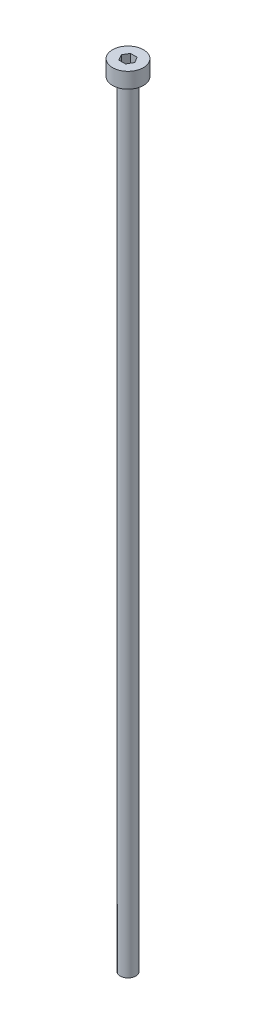
ISO-10303-21;
HEADER;
FILE_DESCRIPTION(('STEP AP214'),'2;1');
FILE_NAME('part.step','',(''),(''),'','','');
FILE_SCHEMA(('AUTOMOTIVE_DESIGN { 1 0 10303 214 1 1 1 1 }'));
ENDSEC;
DATA;
#1=APPLICATION_CONTEXT('core data for automotive mechanical design processes');
#2=APPLICATION_PROTOCOL_DEFINITION('international standard','automotive_design',2000,#1);
#3=PRODUCT_CONTEXT('',#1,'mechanical');
#4=PRODUCT('Part','Part','',(#3));
#5=PRODUCT_RELATED_PRODUCT_CATEGORY('part','',(#4));
#6=PRODUCT_DEFINITION_FORMATION('','',#4);
#7=PRODUCT_DEFINITION_CONTEXT('part definition',#1,'design');
#8=PRODUCT_DEFINITION('design','',#6,#7);
#9=PRODUCT_DEFINITION_SHAPE('','',#8);
#10=(LENGTH_UNIT() NAMED_UNIT(*) SI_UNIT(.MILLI.,.METRE.));
#11=(NAMED_UNIT(*) PLANE_ANGLE_UNIT() SI_UNIT($,.RADIAN.));
#12=(NAMED_UNIT(*) SI_UNIT($,.STERADIAN.) SOLID_ANGLE_UNIT());
#13=UNCERTAINTY_MEASURE_WITH_UNIT(LENGTH_MEASURE(1.E-05),#10,'distance_accuracy_value','');
#14=(GEOMETRIC_REPRESENTATION_CONTEXT(3) GLOBAL_UNCERTAINTY_ASSIGNED_CONTEXT((#13)) GLOBAL_UNIT_ASSIGNED_CONTEXT((#10,
#11,#12)) REPRESENTATION_CONTEXT('',''));
#15=CARTESIAN_POINT('',(0.,0.,0.));
#16=DIRECTION('',(0.,0.,1.));
#17=DIRECTION('',(1.,0.,0.));
#18=AXIS2_PLACEMENT_3D('',#15,#16,#17);
#19=CARTESIAN_POINT('',(0.,2.,0.));
#20=DIRECTION('',(0.,-1.,0.));
#21=DIRECTION('',(0.,0.,-1.));
#22=AXIS2_PLACEMENT_3D('',#19,#20,#21);
#23=CYLINDRICAL_SURFACE('',#22,2.);
#24=CARTESIAN_POINT('',(0.,2.,0.));
#25=DIRECTION('',(0.,1.,0.));
#26=DIRECTION('',(0.,0.,1.));
#27=AXIS2_PLACEMENT_3D('',#24,#25,#26);
#28=CIRCLE('',#27,2.);
#29=CARTESIAN_POINT('',(0.,2.,2.));
#30=VERTEX_POINT('',#29);
#31=EDGE_CURVE('E42',#30,#30,#28,.T.);
#32=ORIENTED_EDGE('',*,*,#31,.F.);
#33=EDGE_LOOP('',(#32));
#34=FACE_BOUND('',#33,.T.);
#35=CARTESIAN_POINT('',(0.,0.,0.));
#36=DIRECTION('',(0.,1.,0.));
#37=DIRECTION('',(0.,0.,1.));
#38=AXIS2_PLACEMENT_3D('',#35,#36,#37);
#39=CIRCLE('',#38,2.);
#40=CARTESIAN_POINT('',(0.,0.,2.));
#41=VERTEX_POINT('',#40);
#42=EDGE_CURVE('E37',#41,#41,#39,.T.);
#43=ORIENTED_EDGE('',*,*,#42,.T.);
#44=EDGE_LOOP('',(#43));
#45=FACE_BOUND('',#44,.T.);
#46=ADVANCED_FACE('F34',(#34,#45),#23,.T.);
#47=CARTESIAN_POINT('',(0.,2.,0.));
#48=DIRECTION('',(0.,1.,0.));
#49=DIRECTION('',(0.,0.,1.));
#50=AXIS2_PLACEMENT_3D('',#47,#48,#49);
#51=PLANE('',#50);
#52=DIRECTION('',(0.5,0.,-0.866025403784439));
#53=VECTOR('',#52,1.);
#54=CARTESIAN_POINT('',(0.433012701892219,2.,0.75));
#55=LINE('',#54,#53);
#56=CARTESIAN_POINT('',(0.433012701892219,2.,0.75));
#57=VERTEX_POINT('',#56);
#58=CARTESIAN_POINT('',(0.866025403784438,2.,0.));
#59=VERTEX_POINT('',#58);
#60=EDGE_CURVE('E50',#57,#59,#55,.T.);
#61=ORIENTED_EDGE('',*,*,#60,.F.);
#62=DIRECTION('',(1.,0.,0.));
#63=VECTOR('',#62,1.);
#64=CARTESIAN_POINT('',(-0.43301270189222,2.,0.75));
#65=LINE('',#64,#63);
#66=CARTESIAN_POINT('',(-0.43301270189222,2.,0.75));
#67=VERTEX_POINT('',#66);
#68=EDGE_CURVE('E134',#67,#57,#65,.T.);
#69=ORIENTED_EDGE('',*,*,#68,.F.);
#70=DIRECTION('',(0.5,0.,0.866025403784439));
#71=VECTOR('',#70,1.);
#72=CARTESIAN_POINT('',(-0.866025403784439,2.,0.));
#73=LINE('',#72,#71);
#74=CARTESIAN_POINT('',(-0.866025403784439,2.,0.));
#75=VERTEX_POINT('',#74);
#76=EDGE_CURVE('E132',#75,#67,#73,.T.);
#77=ORIENTED_EDGE('',*,*,#76,.F.);
#78=DIRECTION('',(-0.5,0.,0.866025403784439));
#79=VECTOR('',#78,1.);
#80=CARTESIAN_POINT('',(-0.43301270189222,2.,-0.750000000000001));
#81=LINE('',#80,#79);
#82=CARTESIAN_POINT('',(-0.43301270189222,2.,-0.750000000000001));
#83=VERTEX_POINT('',#82);
#84=EDGE_CURVE('E98',#83,#75,#81,.T.);
#85=ORIENTED_EDGE('',*,*,#84,.F.);
#86=DIRECTION('',(-1.,0.,0.));
#87=VECTOR('',#86,1.);
#88=CARTESIAN_POINT('',(0.433012701892219,2.,-0.75));
#89=LINE('',#88,#87);
#90=CARTESIAN_POINT('',(0.433012701892219,2.,-0.75));
#91=VERTEX_POINT('',#90);
#92=EDGE_CURVE('E128',#91,#83,#89,.T.);
#93=ORIENTED_EDGE('',*,*,#92,.F.);
#94=DIRECTION('',(-0.5,0.,-0.866025403784439));
#95=VECTOR('',#94,1.);
#96=CARTESIAN_POINT('',(0.866025403784438,2.,0.));
#97=LINE('',#96,#95);
#98=EDGE_CURVE('E124',#59,#91,#97,.T.);
#99=ORIENTED_EDGE('',*,*,#98,.F.);
#100=EDGE_LOOP('',(#61,#69,#77,#85,#93,#99));
#101=FACE_BOUND('',#100,.T.);
#102=ORIENTED_EDGE('',*,*,#31,.T.);
#103=EDGE_LOOP('',(#102));
#104=FACE_BOUND('',#103,.T.);
#105=ADVANCED_FACE('F152',(#101,#104),#51,.T.);
#106=CARTESIAN_POINT('',(0.,0.,0.));
#107=DIRECTION('',(0.,1.,0.));
#108=DIRECTION('',(0.,0.,1.));
#109=AXIS2_PLACEMENT_3D('',#106,#107,#108);
#110=PLANE('',#109);
#111=CARTESIAN_POINT('',(0.,0.,0.));
#112=DIRECTION('',(0.,-1.,0.));
#113=DIRECTION('',(0.,0.,-1.));
#114=AXIS2_PLACEMENT_3D('',#111,#112,#113);
#115=CIRCLE('',#114,1.);
#116=CARTESIAN_POINT('',(0.,0.,-1.));
#117=VERTEX_POINT('',#116);
#118=EDGE_CURVE('E11',#117,#117,#115,.T.);
#119=ORIENTED_EDGE('',*,*,#118,.F.);
#120=EDGE_LOOP('',(#119));
#121=FACE_BOUND('',#120,.T.);
#122=ORIENTED_EDGE('',*,*,#42,.F.);
#123=EDGE_LOOP('',(#122));
#124=FACE_BOUND('',#123,.T.);
#125=ADVANCED_FACE('F149',(#121,#124),#110,.F.);
#126=CARTESIAN_POINT('',(0.433012701892219,0.5,0.75));
#127=DIRECTION('',(0.866025403784439,0.,0.5));
#128=DIRECTION('',(0.5,0.,-0.866025403784439));
#129=AXIS2_PLACEMENT_3D('',#126,#127,#128);
#130=PLANE('',#129);
#131=ORIENTED_EDGE('',*,*,#60,.T.);
#132=DIRECTION('',(0.,1.,0.));
#133=VECTOR('',#132,1.);
#134=CARTESIAN_POINT('',(0.866025403784438,0.5,0.));
#135=LINE('',#134,#133);
#136=CARTESIAN_POINT('',(0.866025403784438,0.5,0.));
#137=VERTEX_POINT('',#136);
#138=EDGE_CURVE('E80',#137,#59,#135,.T.);
#139=ORIENTED_EDGE('',*,*,#138,.F.);
#140=DIRECTION('',(0.5,0.,-0.866025403784439));
#141=VECTOR('',#140,1.);
#142=CARTESIAN_POINT('',(0.433012701892219,0.5,0.75));
#143=LINE('',#142,#141);
#144=CARTESIAN_POINT('',(0.433012701892219,0.5,0.75));
#145=VERTEX_POINT('',#144);
#146=EDGE_CURVE('E136',#145,#137,#143,.T.);
#147=ORIENTED_EDGE('',*,*,#146,.F.);
#148=DIRECTION('',(0.,1.,0.));
#149=VECTOR('',#148,1.);
#150=CARTESIAN_POINT('',(0.433012701892219,0.5,0.75));
#151=LINE('',#150,#149);
#152=EDGE_CURVE('E58',#145,#57,#151,.T.);
#153=ORIENTED_EDGE('',*,*,#152,.T.);
#154=EDGE_LOOP('',(#131,#139,#147,#153));
#155=FACE_BOUND('',#154,.T.);
#156=ADVANCED_FACE('F151',(#155),#130,.F.);
#157=CARTESIAN_POINT('',(-0.43301270189222,0.5,0.75));
#158=DIRECTION('',(0.,0.,1.));
#159=DIRECTION('',(1.,0.,0.));
#160=AXIS2_PLACEMENT_3D('',#157,#158,#159);
#161=PLANE('',#160);
#162=ORIENTED_EDGE('',*,*,#68,.T.);
#163=ORIENTED_EDGE('',*,*,#152,.F.);
#164=DIRECTION('',(1.,0.,0.));
#165=VECTOR('',#164,1.);
#166=CARTESIAN_POINT('',(-0.43301270189222,0.5,0.75));
#167=LINE('',#166,#165);
#168=CARTESIAN_POINT('',(-0.43301270189222,0.5,0.75));
#169=VERTEX_POINT('',#168);
#170=EDGE_CURVE('E110',#169,#145,#167,.T.);
#171=ORIENTED_EDGE('',*,*,#170,.F.);
#172=DIRECTION('',(0.,1.,0.));
#173=VECTOR('',#172,1.);
#174=CARTESIAN_POINT('',(-0.43301270189222,0.5,0.75));
#175=LINE('',#174,#173);
#176=EDGE_CURVE('E102',#169,#67,#175,.T.);
#177=ORIENTED_EDGE('',*,*,#176,.T.);
#178=EDGE_LOOP('',(#162,#163,#171,#177));
#179=FACE_BOUND('',#178,.T.);
#180=ADVANCED_FACE('F158',(#179),#161,.F.);
#181=CARTESIAN_POINT('',(-0.866025403784439,0.5,0.));
#182=DIRECTION('',(-0.866025403784439,0.,0.5));
#183=DIRECTION('',(0.5,0.,0.866025403784439));
#184=AXIS2_PLACEMENT_3D('',#181,#182,#183);
#185=PLANE('',#184);
#186=ORIENTED_EDGE('',*,*,#76,.T.);
#187=ORIENTED_EDGE('',*,*,#176,.F.);
#188=DIRECTION('',(0.5,0.,0.866025403784439));
#189=VECTOR('',#188,1.);
#190=CARTESIAN_POINT('',(-0.866025403784439,0.5,0.));
#191=LINE('',#190,#189);
#192=CARTESIAN_POINT('',(-0.866025403784439,0.5,0.));
#193=VERTEX_POINT('',#192);
#194=EDGE_CURVE('E106',#193,#169,#191,.T.);
#195=ORIENTED_EDGE('',*,*,#194,.F.);
#196=DIRECTION('',(0.,1.,0.));
#197=VECTOR('',#196,1.);
#198=CARTESIAN_POINT('',(-0.866025403784439,0.5,0.));
#199=LINE('',#198,#197);
#200=EDGE_CURVE('E91',#193,#75,#199,.T.);
#201=ORIENTED_EDGE('',*,*,#200,.T.);
#202=EDGE_LOOP('',(#186,#187,#195,#201));
#203=FACE_BOUND('',#202,.T.);
#204=ADVANCED_FACE('F107',(#203),#185,.F.);
#205=CARTESIAN_POINT('',(-0.43301270189222,0.5,-0.750000000000001));
#206=DIRECTION('',(-0.866025403784439,0.,-0.5));
#207=DIRECTION('',(-0.5,0.,0.866025403784439));
#208=AXIS2_PLACEMENT_3D('',#205,#206,#207);
#209=PLANE('',#208);
#210=ORIENTED_EDGE('',*,*,#84,.T.);
#211=ORIENTED_EDGE('',*,*,#200,.F.);
#212=DIRECTION('',(-0.5,0.,0.866025403784439));
#213=VECTOR('',#212,1.);
#214=CARTESIAN_POINT('',(-0.43301270189222,0.5,-0.750000000000001));
#215=LINE('',#214,#213);
#216=CARTESIAN_POINT('',(-0.43301270189222,0.5,-0.750000000000001));
#217=VERTEX_POINT('',#216);
#218=EDGE_CURVE('E95',#217,#193,#215,.T.);
#219=ORIENTED_EDGE('',*,*,#218,.F.);
#220=DIRECTION('',(0.,1.,0.));
#221=VECTOR('',#220,1.);
#222=CARTESIAN_POINT('',(-0.43301270189222,0.5,-0.750000000000001));
#223=LINE('',#222,#221);
#224=EDGE_CURVE('E103',#217,#83,#223,.T.);
#225=ORIENTED_EDGE('',*,*,#224,.T.);
#226=EDGE_LOOP('',(#210,#211,#219,#225));
#227=FACE_BOUND('',#226,.T.);
#228=ADVANCED_FACE('F93',(#227),#209,.F.);
#229=CARTESIAN_POINT('',(0.433012701892219,0.5,-0.75));
#230=DIRECTION('',(0.,0.,-1.));
#231=DIRECTION('',(-1.,0.,0.));
#232=AXIS2_PLACEMENT_3D('',#229,#230,#231);
#233=PLANE('',#232);
#234=ORIENTED_EDGE('',*,*,#92,.T.);
#235=ORIENTED_EDGE('',*,*,#224,.F.);
#236=DIRECTION('',(-1.,0.,0.));
#237=VECTOR('',#236,1.);
#238=CARTESIAN_POINT('',(0.433012701892219,0.5,-0.75));
#239=LINE('',#238,#237);
#240=CARTESIAN_POINT('',(0.433012701892219,0.5,-0.75));
#241=VERTEX_POINT('',#240);
#242=EDGE_CURVE('E116',#241,#217,#239,.T.);
#243=ORIENTED_EDGE('',*,*,#242,.F.);
#244=DIRECTION('',(0.,1.,0.));
#245=VECTOR('',#244,1.);
#246=CARTESIAN_POINT('',(0.433012701892219,0.5,-0.75));
#247=LINE('',#246,#245);
#248=EDGE_CURVE('E140',#241,#91,#247,.T.);
#249=ORIENTED_EDGE('',*,*,#248,.T.);
#250=EDGE_LOOP('',(#234,#235,#243,#249));
#251=FACE_BOUND('',#250,.T.);
#252=ADVANCED_FACE('F203',(#251),#233,.F.);
#253=CARTESIAN_POINT('',(0.866025403784438,0.5,0.));
#254=DIRECTION('',(0.866025403784438,0.,-0.5));
#255=DIRECTION('',(-0.5,0.,-0.866025403784439));
#256=AXIS2_PLACEMENT_3D('',#253,#254,#255);
#257=PLANE('',#256);
#258=ORIENTED_EDGE('',*,*,#98,.T.);
#259=ORIENTED_EDGE('',*,*,#248,.F.);
#260=DIRECTION('',(-0.5,0.,-0.866025403784439));
#261=VECTOR('',#260,1.);
#262=CARTESIAN_POINT('',(0.866025403784438,0.5,0.));
#263=LINE('',#262,#261);
#264=EDGE_CURVE('E118',#137,#241,#263,.T.);
#265=ORIENTED_EDGE('',*,*,#264,.F.);
#266=ORIENTED_EDGE('',*,*,#138,.T.);
#267=EDGE_LOOP('',(#258,#259,#265,#266));
#268=FACE_BOUND('',#267,.T.);
#269=ADVANCED_FACE('F212',(#268),#257,.F.);
#270=CARTESIAN_POINT('',(0.,0.5,0.));
#271=DIRECTION('',(0.,1.,0.));
#272=DIRECTION('',(0.,0.,1.));
#273=AXIS2_PLACEMENT_3D('',#270,#271,#272);
#274=PLANE('',#273);
#275=ORIENTED_EDGE('',*,*,#146,.T.);
#276=ORIENTED_EDGE('',*,*,#264,.T.);
#277=ORIENTED_EDGE('',*,*,#242,.T.);
#278=ORIENTED_EDGE('',*,*,#218,.T.);
#279=ORIENTED_EDGE('',*,*,#194,.T.);
#280=ORIENTED_EDGE('',*,*,#170,.T.);
#281=EDGE_LOOP('',(#275,#276,#277,#278,#279,#280));
#282=FACE_BOUND('',#281,.T.);
#283=ADVANCED_FACE('F113',(#282),#274,.T.);
#284=CARTESIAN_POINT('',(0.,-100.,0.));
#285=DIRECTION('',(0.,1.,0.));
#286=DIRECTION('',(0.,0.,1.));
#287=AXIS2_PLACEMENT_3D('',#284,#285,#286);
#288=CYLINDRICAL_SURFACE('',#287,1.);
#289=CARTESIAN_POINT('',(0.,-100.,0.));
#290=DIRECTION('',(0.,-1.,0.));
#291=DIRECTION('',(0.,0.,-1.));
#292=AXIS2_PLACEMENT_3D('',#289,#290,#291);
#293=CIRCLE('',#292,1.);
#294=CARTESIAN_POINT('',(0.,-100.,-1.));
#295=VERTEX_POINT('',#294);
#296=EDGE_CURVE('E125',#295,#295,#293,.T.);
#297=ORIENTED_EDGE('',*,*,#296,.F.);
#298=EDGE_LOOP('',(#297));
#299=FACE_BOUND('',#298,.T.);
#300=ORIENTED_EDGE('',*,*,#118,.T.);
#301=EDGE_LOOP('',(#300));
#302=FACE_BOUND('',#301,.T.);
#303=ADVANCED_FACE('F230',(#299,#302),#288,.T.);
#304=CARTESIAN_POINT('',(0.,-100.,0.));
#305=DIRECTION('',(0.,-1.,0.));
#306=DIRECTION('',(0.,0.,-1.));
#307=AXIS2_PLACEMENT_3D('',#304,#305,#306);
#308=PLANE('',#307);
#309=ORIENTED_EDGE('',*,*,#296,.T.);
#310=EDGE_LOOP('',(#309));
#311=FACE_BOUND('',#310,.T.);
#312=ADVANCED_FACE('F243',(#311),#308,.T.);
#313=CLOSED_SHELL('',(#46,#105,#125,#156,#180,#204,#228,#252,#269,#283,#303,#312));
#314=MANIFOLD_SOLID_BREP('B2',#313);
#315=ADVANCED_BREP_SHAPE_REPRESENTATION('',(#18,#314),#14);
#316=SHAPE_DEFINITION_REPRESENTATION(#9,#315);
ENDSEC;
END-ISO-10303-21;
